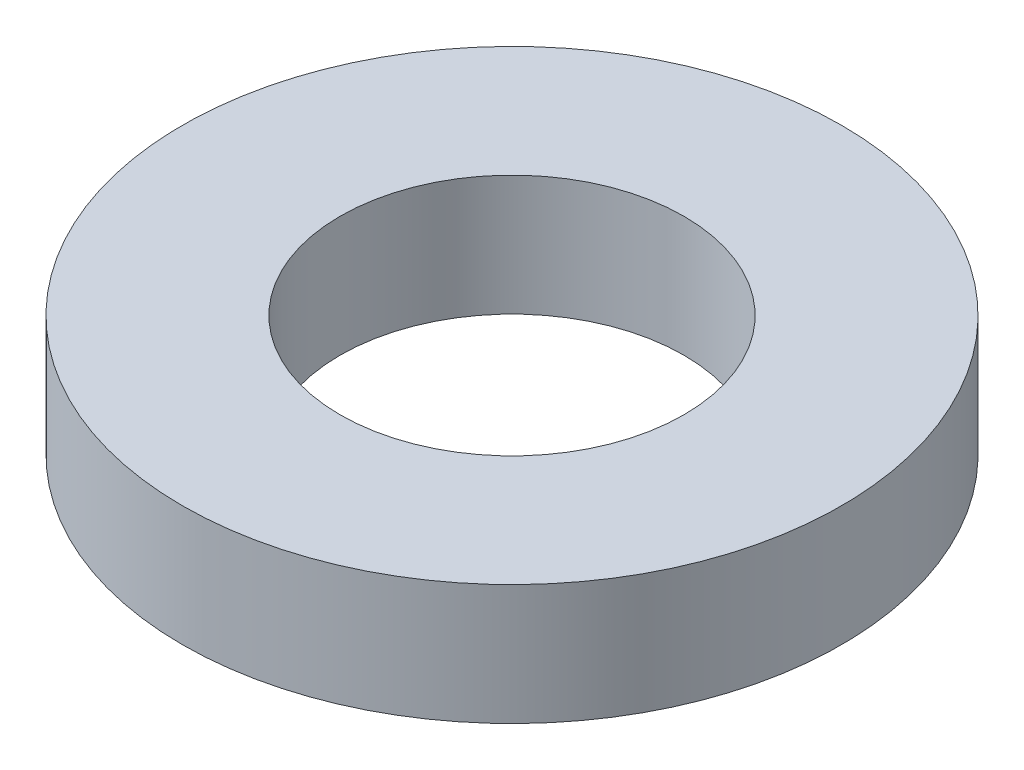
ISO-10303-21;
HEADER;
FILE_DESCRIPTION(('STEP AP214'),'2;1');
FILE_NAME('part.step','',(''),(''),'','','');
FILE_SCHEMA(('AUTOMOTIVE_DESIGN { 1 0 10303 214 1 1 1 1 }'));
ENDSEC;
DATA;
#1=APPLICATION_CONTEXT('core data for automotive mechanical design processes');
#2=APPLICATION_PROTOCOL_DEFINITION('international standard','automotive_design',2000,#1);
#3=PRODUCT_CONTEXT('',#1,'mechanical');
#4=PRODUCT('Part','Part','',(#3));
#5=PRODUCT_RELATED_PRODUCT_CATEGORY('part','',(#4));
#6=PRODUCT_DEFINITION_FORMATION('','',#4);
#7=PRODUCT_DEFINITION_CONTEXT('part definition',#1,'design');
#8=PRODUCT_DEFINITION('design','',#6,#7);
#9=PRODUCT_DEFINITION_SHAPE('','',#8);
#10=(LENGTH_UNIT() NAMED_UNIT(*) SI_UNIT(.MILLI.,.METRE.));
#11=(NAMED_UNIT(*) PLANE_ANGLE_UNIT() SI_UNIT($,.RADIAN.));
#12=(NAMED_UNIT(*) SI_UNIT($,.STERADIAN.) SOLID_ANGLE_UNIT());
#13=UNCERTAINTY_MEASURE_WITH_UNIT(LENGTH_MEASURE(1.E-05),#10,'distance_accuracy_value','');
#14=(GEOMETRIC_REPRESENTATION_CONTEXT(3) GLOBAL_UNCERTAINTY_ASSIGNED_CONTEXT((#13)) GLOBAL_UNIT_ASSIGNED_CONTEXT((#10,
#11,#12)) REPRESENTATION_CONTEXT('',''));
#15=CARTESIAN_POINT('',(0.,0.,0.));
#16=DIRECTION('',(0.,0.,1.));
#17=DIRECTION('',(1.,0.,0.));
#18=AXIS2_PLACEMENT_3D('',#15,#16,#17);
#19=CARTESIAN_POINT('',(0.,21.,0.));
#20=DIRECTION('',(0.,-1.,0.));
#21=DIRECTION('',(0.,0.,-1.));
#22=AXIS2_PLACEMENT_3D('',#19,#20,#21);
#23=CYLINDRICAL_SURFACE('',#22,57.5);
#24=CARTESIAN_POINT('',(0.,21.,0.));
#25=DIRECTION('',(0.,1.,0.));
#26=DIRECTION('',(0.,0.,1.));
#27=AXIS2_PLACEMENT_3D('',#24,#25,#26);
#28=CIRCLE('',#27,57.5);
#29=CARTESIAN_POINT('',(0.,21.,-57.5));
#30=VERTEX_POINT('',#29);
#31=EDGE_CURVE('E10',#30,#30,#28,.T.);
#32=CARTESIAN_POINT('',(0.,0.,0.));
#33=DIRECTION('',(0.,1.,0.));
#34=DIRECTION('',(0.,0.,1.));
#35=AXIS2_PLACEMENT_3D('',#32,#33,#34);
#36=CIRCLE('',#35,57.5);
#37=CARTESIAN_POINT('',(0.,0.,-57.5));
#38=VERTEX_POINT('',#37);
#39=EDGE_CURVE('E37',#38,#38,#36,.T.);
#40=CARTESIAN_POINT('',(0.,21.,-57.5));
#41=CARTESIAN_POINT('',(0.,20.78125,-57.5));
#42=CARTESIAN_POINT('',(0.,20.5625,-57.5));
#43=CARTESIAN_POINT('',(0.,20.125,-57.5));
#44=CARTESIAN_POINT('',(0.,19.90625,-57.5));
#45=CARTESIAN_POINT('',(0.,19.46875,-57.5));
#46=CARTESIAN_POINT('',(0.,19.25,-57.5));
#47=CARTESIAN_POINT('',(0.,18.8125,-57.5));
#48=CARTESIAN_POINT('',(0.,18.59375,-57.5));
#49=CARTESIAN_POINT('',(0.,18.15625,-57.5));
#50=CARTESIAN_POINT('',(0.,17.9375,-57.5));
#51=CARTESIAN_POINT('',(0.,17.5,-57.5));
#52=CARTESIAN_POINT('',(0.,17.28125,-57.5));
#53=CARTESIAN_POINT('',(0.,16.84375,-57.5));
#54=CARTESIAN_POINT('',(0.,16.625,-57.5));
#55=CARTESIAN_POINT('',(0.,16.1875,-57.5));
#56=CARTESIAN_POINT('',(0.,15.96875,-57.5));
#57=CARTESIAN_POINT('',(0.,15.53125,-57.5));
#58=CARTESIAN_POINT('',(0.,15.3125,-57.5));
#59=CARTESIAN_POINT('',(0.,14.875,-57.5));
#60=CARTESIAN_POINT('',(0.,14.65625,-57.5));
#61=CARTESIAN_POINT('',(0.,14.21875,-57.5));
#62=CARTESIAN_POINT('',(0.,14.,-57.5));
#63=CARTESIAN_POINT('',(0.,13.5625,-57.5));
#64=CARTESIAN_POINT('',(0.,13.34375,-57.5));
#65=CARTESIAN_POINT('',(0.,12.90625,-57.5));
#66=CARTESIAN_POINT('',(0.,12.6875,-57.5));
#67=CARTESIAN_POINT('',(0.,12.25,-57.5));
#68=CARTESIAN_POINT('',(0.,12.03125,-57.5));
#69=CARTESIAN_POINT('',(0.,11.59375,-57.5));
#70=CARTESIAN_POINT('',(0.,11.375,-57.5));
#71=CARTESIAN_POINT('',(0.,10.9375,-57.5));
#72=CARTESIAN_POINT('',(0.,10.71875,-57.5));
#73=CARTESIAN_POINT('',(0.,10.28125,-57.5));
#74=CARTESIAN_POINT('',(0.,10.0625,-57.5));
#75=CARTESIAN_POINT('',(0.,9.625,-57.5));
#76=CARTESIAN_POINT('',(0.,9.40625,-57.5));
#77=CARTESIAN_POINT('',(0.,8.96875,-57.5));
#78=CARTESIAN_POINT('',(0.,8.75,-57.5));
#79=CARTESIAN_POINT('',(0.,8.3125,-57.5));
#80=CARTESIAN_POINT('',(0.,8.09375,-57.5));
#81=CARTESIAN_POINT('',(0.,7.65625,-57.5));
#82=CARTESIAN_POINT('',(0.,7.4375,-57.5));
#83=CARTESIAN_POINT('',(0.,7.,-57.5));
#84=CARTESIAN_POINT('',(0.,6.78125,-57.5));
#85=CARTESIAN_POINT('',(0.,6.34375,-57.5));
#86=CARTESIAN_POINT('',(0.,6.125,-57.5));
#87=CARTESIAN_POINT('',(0.,5.6875,-57.5));
#88=CARTESIAN_POINT('',(0.,5.46875,-57.5));
#89=CARTESIAN_POINT('',(0.,5.03125,-57.5));
#90=CARTESIAN_POINT('',(0.,4.8125,-57.5));
#91=CARTESIAN_POINT('',(0.,4.375,-57.5));
#92=CARTESIAN_POINT('',(0.,4.15625,-57.5));
#93=CARTESIAN_POINT('',(0.,3.71875,-57.5));
#94=CARTESIAN_POINT('',(0.,3.5,-57.5));
#95=CARTESIAN_POINT('',(0.,3.0625,-57.5));
#96=CARTESIAN_POINT('',(0.,2.84375,-57.5));
#97=CARTESIAN_POINT('',(0.,2.40625,-57.5));
#98=CARTESIAN_POINT('',(0.,2.1875,-57.5));
#99=CARTESIAN_POINT('',(0.,1.75,-57.5));
#100=CARTESIAN_POINT('',(0.,1.53125,-57.5));
#101=CARTESIAN_POINT('',(0.,1.09375,-57.5));
#102=CARTESIAN_POINT('',(0.,0.875000000000001,-57.5));
#103=CARTESIAN_POINT('',(0.,0.4375,-57.5));
#104=CARTESIAN_POINT('',(0.,0.21875,-57.5));
#105=CARTESIAN_POINT('',(0.,0.,-57.5));
#106=B_SPLINE_CURVE_WITH_KNOTS('',3,(#40,#41,#42,#43,#44,#45,#46,#47,#48,#49,#50,#51,#52,#53,
#54,#55,#56,#57,#58,#59,#60,#61,#62,#63,#64,#65,#66,#67,#68,#69,#70,#71,#72,#73,#74,#75,#76,#77,
#78,#79,#80,#81,#82,#83,#84,#85,#86,#87,#88,#89,#90,#91,#92,#93,#94,#95,#96,#97,#98,#99,#100,
#101,#102,#103,#104,#105),.UNSPECIFIED.,.F.,.F.,(4,2,2,2,2,2,2,2,2,2,2,2,2,2,2,2,2,2,2,2,2,2,2,
2,2,2,2,2,2,2,2,2,4),(0.,0.656250000000001,1.3125,1.96875,2.625,3.28125,3.9375,4.59375,5.25,
5.90625,6.5625,7.21875,7.875,8.53125,9.1875,9.84375,10.5,11.15625,11.8125,12.46875,13.125,
13.78125,14.4375,15.09375,15.75,16.40625,17.0625,17.71875,18.375,19.03125,19.6875,20.34375,21.),.UNSPECIFIED.);
#107=EDGE_CURVE('BSEAM40',#30,#38,#106,.T.);
#108=ORIENTED_EDGE('',*,*,#31,.F.);
#109=ORIENTED_EDGE('',*,*,#39,.T.);
#110=ORIENTED_EDGE('',*,*,#107,.T.);
#111=ORIENTED_EDGE('',*,*,#107,.F.);
#112=EDGE_LOOP('',(#108,#110,#109,#111));
#113=FACE_BOUND('',#112,.T.);
#114=ADVANCED_FACE('F40',(#113),#23,.T.);
#115=CARTESIAN_POINT('',(0.,21.,0.));
#116=DIRECTION('',(0.,1.,0.));
#117=DIRECTION('',(0.,0.,1.));
#118=AXIS2_PLACEMENT_3D('',#115,#116,#117);
#119=PLANE('',#118);
#120=CARTESIAN_POINT('',(0.,21.,0.));
#121=DIRECTION('',(0.,1.,0.));
#122=DIRECTION('',(0.,0.,1.));
#123=AXIS2_PLACEMENT_3D('',#120,#121,#122);
#124=CIRCLE('',#123,30.);
#125=CARTESIAN_POINT('',(0.,21.,-30.));
#126=VERTEX_POINT('',#125);
#127=EDGE_CURVE('E50',#126,#126,#124,.T.);
#128=ORIENTED_EDGE('',*,*,#127,.F.);
#129=EDGE_LOOP('',(#128));
#130=FACE_BOUND('',#129,.T.);
#131=ORIENTED_EDGE('',*,*,#31,.T.);
#132=EDGE_LOOP('',(#131));
#133=FACE_BOUND('',#132,.T.);
#134=ADVANCED_FACE('F59',(#130,#133),#119,.T.);
#135=CARTESIAN_POINT('',(0.,0.,0.));
#136=DIRECTION('',(0.,1.,0.));
#137=DIRECTION('',(0.,0.,1.));
#138=AXIS2_PLACEMENT_3D('',#135,#136,#137);
#139=PLANE('',#138);
#140=CARTESIAN_POINT('',(0.,0.,0.));
#141=DIRECTION('',(0.,1.,0.));
#142=DIRECTION('',(0.,0.,1.));
#143=AXIS2_PLACEMENT_3D('',#140,#141,#142);
#144=CIRCLE('',#143,30.);
#145=CARTESIAN_POINT('',(0.,0.,-30.));
#146=VERTEX_POINT('',#145);
#147=EDGE_CURVE('E47',#146,#146,#144,.T.);
#148=ORIENTED_EDGE('',*,*,#147,.T.);
#149=EDGE_LOOP('',(#148));
#150=FACE_BOUND('',#149,.T.);
#151=ORIENTED_EDGE('',*,*,#39,.F.);
#152=EDGE_LOOP('',(#151));
#153=FACE_BOUND('',#152,.T.);
#154=ADVANCED_FACE('F58',(#150,#153),#139,.F.);
#155=CARTESIAN_POINT('',(0.,21.,0.));
#156=DIRECTION('',(0.,-1.,0.));
#157=DIRECTION('',(0.,0.,-1.));
#158=AXIS2_PLACEMENT_3D('',#155,#156,#157);
#159=CYLINDRICAL_SURFACE('',#158,30.);
#160=CARTESIAN_POINT('',(0.,21.,-30.));
#161=CARTESIAN_POINT('',(0.,20.78125,-30.));
#162=CARTESIAN_POINT('',(0.,20.5625,-30.));
#163=CARTESIAN_POINT('',(0.,20.125,-30.));
#164=CARTESIAN_POINT('',(0.,19.90625,-30.));
#165=CARTESIAN_POINT('',(0.,19.46875,-30.));
#166=CARTESIAN_POINT('',(0.,19.25,-30.));
#167=CARTESIAN_POINT('',(0.,18.8125,-30.));
#168=CARTESIAN_POINT('',(0.,18.59375,-30.));
#169=CARTESIAN_POINT('',(0.,18.15625,-30.));
#170=CARTESIAN_POINT('',(0.,17.9375,-30.));
#171=CARTESIAN_POINT('',(0.,17.5,-30.));
#172=CARTESIAN_POINT('',(0.,17.28125,-30.));
#173=CARTESIAN_POINT('',(0.,16.84375,-30.));
#174=CARTESIAN_POINT('',(0.,16.625,-30.));
#175=CARTESIAN_POINT('',(0.,16.1875,-30.));
#176=CARTESIAN_POINT('',(0.,15.96875,-30.));
#177=CARTESIAN_POINT('',(0.,15.53125,-30.));
#178=CARTESIAN_POINT('',(0.,15.3125,-30.));
#179=CARTESIAN_POINT('',(0.,14.875,-30.));
#180=CARTESIAN_POINT('',(0.,14.65625,-30.));
#181=CARTESIAN_POINT('',(0.,14.21875,-30.));
#182=CARTESIAN_POINT('',(0.,14.,-30.));
#183=CARTESIAN_POINT('',(0.,13.5625,-30.));
#184=CARTESIAN_POINT('',(0.,13.34375,-30.));
#185=CARTESIAN_POINT('',(0.,12.90625,-30.));
#186=CARTESIAN_POINT('',(0.,12.6875,-30.));
#187=CARTESIAN_POINT('',(0.,12.25,-30.));
#188=CARTESIAN_POINT('',(0.,12.03125,-30.));
#189=CARTESIAN_POINT('',(0.,11.59375,-30.));
#190=CARTESIAN_POINT('',(0.,11.375,-30.));
#191=CARTESIAN_POINT('',(0.,10.9375,-30.));
#192=CARTESIAN_POINT('',(0.,10.71875,-30.));
#193=CARTESIAN_POINT('',(0.,10.28125,-30.));
#194=CARTESIAN_POINT('',(0.,10.0625,-30.));
#195=CARTESIAN_POINT('',(0.,9.625,-30.));
#196=CARTESIAN_POINT('',(0.,9.40625,-30.));
#197=CARTESIAN_POINT('',(0.,8.96875,-30.));
#198=CARTESIAN_POINT('',(0.,8.75,-30.));
#199=CARTESIAN_POINT('',(0.,8.3125,-30.));
#200=CARTESIAN_POINT('',(0.,8.09375,-30.));
#201=CARTESIAN_POINT('',(0.,7.65625,-30.));
#202=CARTESIAN_POINT('',(0.,7.4375,-30.));
#203=CARTESIAN_POINT('',(0.,7.,-30.));
#204=CARTESIAN_POINT('',(0.,6.78125,-30.));
#205=CARTESIAN_POINT('',(0.,6.34375,-30.));
#206=CARTESIAN_POINT('',(0.,6.125,-30.));
#207=CARTESIAN_POINT('',(0.,5.6875,-30.));
#208=CARTESIAN_POINT('',(0.,5.46875,-30.));
#209=CARTESIAN_POINT('',(0.,5.03125,-30.));
#210=CARTESIAN_POINT('',(0.,4.8125,-30.));
#211=CARTESIAN_POINT('',(0.,4.375,-30.));
#212=CARTESIAN_POINT('',(0.,4.15625,-30.));
#213=CARTESIAN_POINT('',(0.,3.71875,-30.));
#214=CARTESIAN_POINT('',(0.,3.5,-30.));
#215=CARTESIAN_POINT('',(0.,3.0625,-30.));
#216=CARTESIAN_POINT('',(0.,2.84375,-30.));
#217=CARTESIAN_POINT('',(0.,2.40625,-30.));
#218=CARTESIAN_POINT('',(0.,2.1875,-30.));
#219=CARTESIAN_POINT('',(0.,1.75,-30.));
#220=CARTESIAN_POINT('',(0.,1.53125,-30.));
#221=CARTESIAN_POINT('',(0.,1.09375,-30.));
#222=CARTESIAN_POINT('',(0.,0.875000000000001,-30.));
#223=CARTESIAN_POINT('',(0.,0.4375,-30.));
#224=CARTESIAN_POINT('',(0.,0.21875,-30.));
#225=CARTESIAN_POINT('',(0.,0.,-30.));
#226=B_SPLINE_CURVE_WITH_KNOTS('',3,(#160,#161,#162,#163,#164,#165,#166,#167,#168,#169,#170,
#171,#172,#173,#174,#175,#176,#177,#178,#179,#180,#181,#182,#183,#184,#185,#186,#187,#188,#189,
#190,#191,#192,#193,#194,#195,#196,#197,#198,#199,#200,#201,#202,#203,#204,#205,#206,#207,#208,
#209,#210,#211,#212,#213,#214,#215,#216,#217,#218,#219,#220,#221,#222,#223,#224,#225),
.UNSPECIFIED.,.F.,.F.,(4,2,2,2,2,2,2,2,2,2,2,2,2,2,2,2,2,2,2,2,2,2,2,2,2,2,2,2,2,2,2,2,4),(0.,
0.656249999999997,1.3125,1.96875,2.625,3.28125,3.9375,4.59375,5.25,5.90625,6.5625,7.21875,7.875,
8.53125,9.1875,9.84375,10.5,11.15625,11.8125,12.46875,13.125,13.78125,14.4375,15.09375,15.75,
16.40625,17.0625,17.71875,18.375,19.03125,19.6875,20.34375,21.),.UNSPECIFIED.);
#227=EDGE_CURVE('BSEAM54',#126,#146,#226,.T.);
#228=ORIENTED_EDGE('',*,*,#127,.T.);
#229=ORIENTED_EDGE('',*,*,#147,.F.);
#230=ORIENTED_EDGE('',*,*,#227,.T.);
#231=ORIENTED_EDGE('',*,*,#227,.F.);
#232=EDGE_LOOP('',(#228,#230,#229,#231));
#233=FACE_BOUND('',#232,.T.);
#234=ADVANCED_FACE('F54',(#233),#159,.F.);
#235=CLOSED_SHELL('',(#114,#134,#154,#234));
#236=MANIFOLD_SOLID_BREP('B2',#235);
#237=ADVANCED_BREP_SHAPE_REPRESENTATION('',(#18,#236),#14);
#238=SHAPE_DEFINITION_REPRESENTATION(#9,#237);
ENDSEC;
END-ISO-10303-21;
